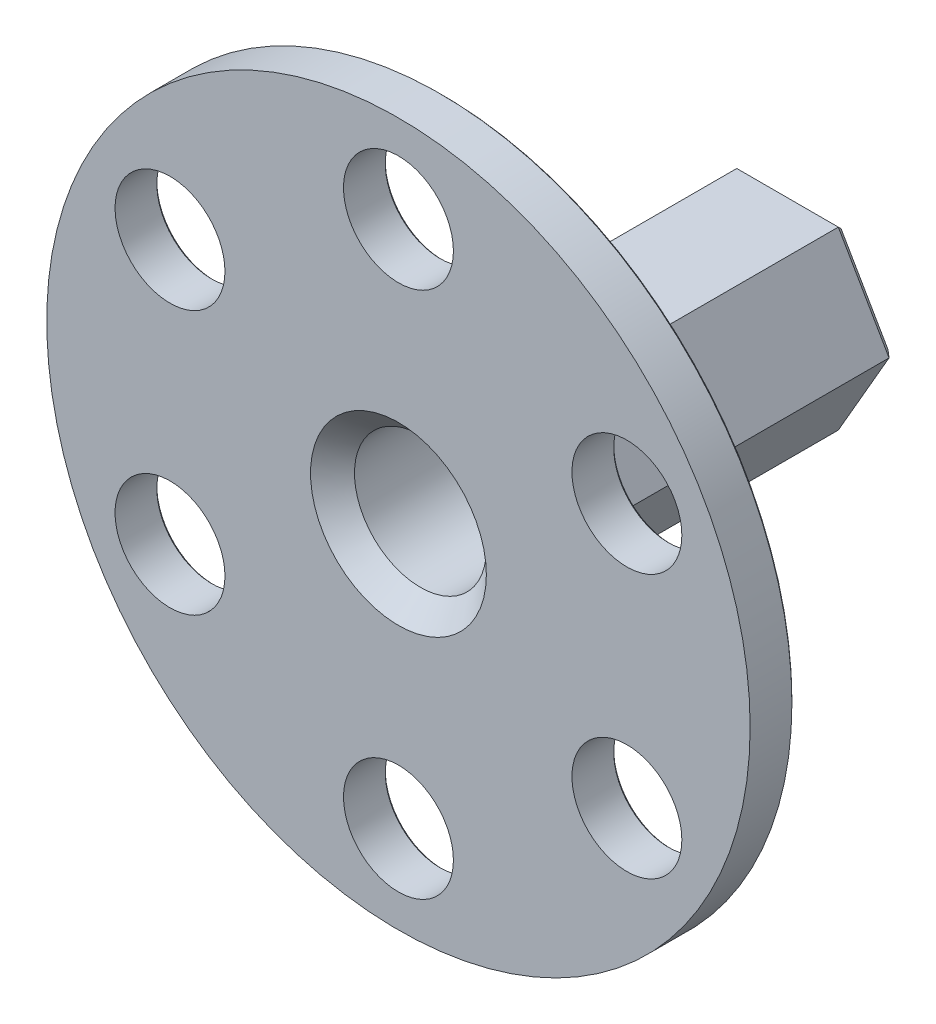
ISO-10303-21;
HEADER;
FILE_DESCRIPTION(('STEP AP214'),'2;1');
FILE_NAME('part.step','',(''),(''),'','','');
FILE_SCHEMA(('AUTOMOTIVE_DESIGN { 1 0 10303 214 1 1 1 1 }'));
ENDSEC;
DATA;
#1=APPLICATION_CONTEXT('core data for automotive mechanical design processes');
#2=APPLICATION_PROTOCOL_DEFINITION('international standard','automotive_design',2000,#1);
#3=PRODUCT_CONTEXT('',#1,'mechanical');
#4=PRODUCT('Part','Part','',(#3));
#5=PRODUCT_RELATED_PRODUCT_CATEGORY('part','',(#4));
#6=PRODUCT_DEFINITION_FORMATION('','',#4);
#7=PRODUCT_DEFINITION_CONTEXT('part definition',#1,'design');
#8=PRODUCT_DEFINITION('design','',#6,#7);
#9=PRODUCT_DEFINITION_SHAPE('','',#8);
#10=(LENGTH_UNIT() NAMED_UNIT(*) SI_UNIT(.MILLI.,.METRE.));
#11=(NAMED_UNIT(*) PLANE_ANGLE_UNIT() SI_UNIT($,.RADIAN.));
#12=(NAMED_UNIT(*) SI_UNIT($,.STERADIAN.) SOLID_ANGLE_UNIT());
#13=UNCERTAINTY_MEASURE_WITH_UNIT(LENGTH_MEASURE(1.E-05),#10,'distance_accuracy_value','');
#14=(GEOMETRIC_REPRESENTATION_CONTEXT(3) GLOBAL_UNCERTAINTY_ASSIGNED_CONTEXT((#13)) GLOBAL_UNIT_ASSIGNED_CONTEXT((#10,
#11,#12)) REPRESENTATION_CONTEXT('',''));
#15=CARTESIAN_POINT('',(0.,0.,0.));
#16=DIRECTION('',(0.,0.,1.));
#17=DIRECTION('',(1.,0.,0.));
#18=AXIS2_PLACEMENT_3D('',#15,#16,#17);
#19=CARTESIAN_POINT('',(0.,0.,-4.));
#20=DIRECTION('',(0.,0.,1.));
#21=DIRECTION('',(1.,0.,0.));
#22=AXIS2_PLACEMENT_3D('',#19,#20,#21);
#23=PLANE('',#22);
#24=CARTESIAN_POINT('',(0.,-24.,-4.));
#25=DIRECTION('',(0.,0.,1.));
#26=DIRECTION('',(1.,0.,0.));
#27=AXIS2_PLACEMENT_3D('',#24,#25,#26);
#28=CIRCLE('',#27,5.2);
#29=CARTESIAN_POINT('',(5.2,-24.,-4.));
#30=VERTEX_POINT('',#29);
#31=EDGE_CURVE('E219',#30,#30,#28,.T.);
#32=ORIENTED_EDGE('',*,*,#31,.T.);
#33=EDGE_LOOP('',(#32));
#34=FACE_BOUND('',#33,.T.);
#35=CARTESIAN_POINT('',(20.7846096908265,-12.0000000000001,-4.));
#36=DIRECTION('',(0.,0.,1.));
#37=DIRECTION('',(1.,0.,0.));
#38=AXIS2_PLACEMENT_3D('',#35,#36,#37);
#39=CIRCLE('',#38,5.20000000000001);
#40=CARTESIAN_POINT('',(25.9846096908265,-12.0000000000001,-4.));
#41=VERTEX_POINT('',#40);
#42=EDGE_CURVE('E216',#41,#41,#39,.T.);
#43=ORIENTED_EDGE('',*,*,#42,.T.);
#44=EDGE_LOOP('',(#43));
#45=FACE_BOUND('',#44,.T.);
#46=CARTESIAN_POINT('',(20.7846096908266,12.,-4.));
#47=DIRECTION('',(0.,0.,1.));
#48=DIRECTION('',(1.,0.,0.));
#49=AXIS2_PLACEMENT_3D('',#46,#47,#48);
#50=CIRCLE('',#49,5.2);
#51=CARTESIAN_POINT('',(25.9846096908266,12.,-4.));
#52=VERTEX_POINT('',#51);
#53=EDGE_CURVE('E213',#52,#52,#50,.T.);
#54=ORIENTED_EDGE('',*,*,#53,.T.);
#55=EDGE_LOOP('',(#54));
#56=FACE_BOUND('',#55,.T.);
#57=CARTESIAN_POINT('',(0.,24.,-4.));
#58=DIRECTION('',(0.,0.,1.));
#59=DIRECTION('',(1.,0.,0.));
#60=AXIS2_PLACEMENT_3D('',#57,#58,#59);
#61=CIRCLE('',#60,5.2);
#62=CARTESIAN_POINT('',(5.2,24.,-4.));
#63=VERTEX_POINT('',#62);
#64=EDGE_CURVE('E210',#63,#63,#61,.T.);
#65=ORIENTED_EDGE('',*,*,#64,.T.);
#66=EDGE_LOOP('',(#65));
#67=FACE_BOUND('',#66,.T.);
#68=CARTESIAN_POINT('',(-20.7846096908264,12.0000000000002,-4.));
#69=DIRECTION('',(0.,0.,1.));
#70=DIRECTION('',(1.,0.,0.));
#71=AXIS2_PLACEMENT_3D('',#68,#69,#70);
#72=CIRCLE('',#71,5.20000000000002);
#73=CARTESIAN_POINT('',(-15.5846096908264,12.0000000000002,-4.));
#74=VERTEX_POINT('',#73);
#75=EDGE_CURVE('E207',#74,#74,#72,.T.);
#76=ORIENTED_EDGE('',*,*,#75,.T.);
#77=EDGE_LOOP('',(#76));
#78=FACE_BOUND('',#77,.T.);
#79=CARTESIAN_POINT('',(-20.7846096908266,-11.9999999999998,-4.));
#80=DIRECTION('',(0.,0.,1.));
#81=DIRECTION('',(1.,0.,0.));
#82=AXIS2_PLACEMENT_3D('',#79,#80,#81);
#83=CIRCLE('',#82,5.20000000000002);
#84=CARTESIAN_POINT('',(-15.5846096908266,-11.9999999999998,-4.));
#85=VERTEX_POINT('',#84);
#86=EDGE_CURVE('E204',#85,#85,#83,.T.);
#87=ORIENTED_EDGE('',*,*,#86,.T.);
#88=EDGE_LOOP('',(#87));
#89=FACE_BOUND('',#88,.T.);
#90=CARTESIAN_POINT('',(0.,0.,-4.));
#91=DIRECTION('',(0.,0.,1.));
#92=DIRECTION('',(1.,0.,0.));
#93=AXIS2_PLACEMENT_3D('',#90,#91,#92);
#94=CIRCLE('',#93,31.8);
#95=CARTESIAN_POINT('',(31.8,0.,-4.));
#96=VERTEX_POINT('',#95);
#97=EDGE_CURVE('E188',#96,#96,#94,.F.);
#98=ORIENTED_EDGE('',*,*,#97,.T.);
#99=EDGE_LOOP('',(#98));
#100=FACE_BOUND('',#99,.T.);
#101=DIRECTION('',(0.5,0.866025403784439,0.));
#102=VECTOR('',#101,1.);
#103=CARTESIAN_POINT('',(10.9696551146029,-0.999999999999984,-4.));
#104=LINE('',#103,#102);
#105=CARTESIAN_POINT('',(5.77350269189624,-9.99999999999997,-4.));
#106=VERTEX_POINT('',#105);
#107=CARTESIAN_POINT('',(11.5470053837925,0.,-4.));
#108=VERTEX_POINT('',#107);
#109=EDGE_CURVE('E176',#106,#108,#104,.T.);
#110=ORIENTED_EDGE('',*,*,#109,.T.);
#111=DIRECTION('',(-0.5,0.866025403784439,0.));
#112=VECTOR('',#111,1.);
#113=CARTESIAN_POINT('',(6.35085296108586,8.99999999999999,-4.));
#114=LINE('',#113,#112);
#115=CARTESIAN_POINT('',(5.77350269189624,9.99999999999997,-4.));
#116=VERTEX_POINT('',#115);
#117=EDGE_CURVE('E147',#108,#116,#114,.T.);
#118=ORIENTED_EDGE('',*,*,#117,.T.);
#119=DIRECTION('',(-1.,0.,0.));
#120=VECTOR('',#119,1.);
#121=CARTESIAN_POINT('',(-4.61880215351701,9.99999999999997,-4.));
#122=LINE('',#121,#120);
#123=CARTESIAN_POINT('',(-5.77350269189624,9.99999999999997,-4.));
#124=VERTEX_POINT('',#123);
#125=EDGE_CURVE('E161',#116,#124,#122,.T.);
#126=ORIENTED_EDGE('',*,*,#125,.T.);
#127=DIRECTION('',(-0.5,-0.866025403784439,0.));
#128=VECTOR('',#127,1.);
#129=CARTESIAN_POINT('',(-10.9696551146029,0.999999999999987,-4.));
#130=LINE('',#129,#128);
#131=CARTESIAN_POINT('',(-11.5470053837925,0.,-4.));
#132=VERTEX_POINT('',#131);
#133=EDGE_CURVE('E164',#124,#132,#130,.T.);
#134=ORIENTED_EDGE('',*,*,#133,.T.);
#135=DIRECTION('',(0.5,-0.866025403784439,0.));
#136=VECTOR('',#135,1.);
#137=CARTESIAN_POINT('',(-6.35085296108586,-8.99999999999999,-4.));
#138=LINE('',#137,#136);
#139=CARTESIAN_POINT('',(-5.77350269189624,-9.99999999999997,-4.));
#140=VERTEX_POINT('',#139);
#141=EDGE_CURVE('E172',#132,#140,#138,.T.);
#142=ORIENTED_EDGE('',*,*,#141,.T.);
#143=DIRECTION('',(1.,0.,0.));
#144=VECTOR('',#143,1.);
#145=CARTESIAN_POINT('',(4.61880215351701,-9.99999999999997,-4.));
#146=LINE('',#145,#144);
#147=EDGE_CURVE('E174',#140,#106,#146,.T.);
#148=ORIENTED_EDGE('',*,*,#147,.T.);
#149=EDGE_LOOP('',(#110,#118,#126,#134,#142,#148));
#150=FACE_BOUND('',#149,.T.);
#151=ADVANCED_FACE('F39',(#34,#45,#56,#67,#78,#89,#100,#150),#23,.F.);
#152=CARTESIAN_POINT('',(0.,0.,-4.));
#153=DIRECTION('',(0.,0.,1.));
#154=DIRECTION('',(1.,0.,0.));
#155=AXIS2_PLACEMENT_3D('',#152,#153,#154);
#156=CYLINDRICAL_SURFACE('',#155,32.);
#157=CARTESIAN_POINT('',(0.,0.,-3.80000000000002));
#158=DIRECTION('',(0.,0.,1.));
#159=DIRECTION('',(1.,0.,0.));
#160=AXIS2_PLACEMENT_3D('',#157,#158,#159);
#161=CIRCLE('',#160,32.);
#162=CARTESIAN_POINT('',(32.,0.,-3.80000000000002));
#163=VERTEX_POINT('',#162);
#164=EDGE_CURVE('E240',#163,#163,#161,.T.);
#165=ORIENTED_EDGE('',*,*,#164,.T.);
#166=EDGE_LOOP('',(#165));
#167=FACE_BOUND('',#166,.T.);
#168=CARTESIAN_POINT('',(0.,0.,0.));
#169=DIRECTION('',(0.,0.,1.));
#170=DIRECTION('',(1.,0.,0.));
#171=AXIS2_PLACEMENT_3D('',#168,#169,#170);
#172=CIRCLE('',#171,32.);
#173=CARTESIAN_POINT('',(32.,0.,0.));
#174=VERTEX_POINT('',#173);
#175=EDGE_CURVE('E162',#174,#174,#172,.T.);
#176=ORIENTED_EDGE('',*,*,#175,.F.);
#177=EDGE_LOOP('',(#176));
#178=FACE_BOUND('',#177,.T.);
#179=ADVANCED_FACE('F303',(#167,#178),#156,.T.);
#180=CARTESIAN_POINT('',(0.,0.,0.));
#181=DIRECTION('',(0.,0.,1.));
#182=DIRECTION('',(1.,0.,0.));
#183=AXIS2_PLACEMENT_3D('',#180,#181,#182);
#184=PLANE('',#183);
#185=CARTESIAN_POINT('',(0.,0.,0.));
#186=DIRECTION('',(0.,0.,1.));
#187=DIRECTION('',(1.,0.,0.));
#188=AXIS2_PLACEMENT_3D('',#185,#186,#187);
#189=CIRCLE('',#188,7.99999999999998);
#190=CARTESIAN_POINT('',(7.99999999999998,0.,0.));
#191=VERTEX_POINT('',#190);
#192=EDGE_CURVE('E11',#191,#191,#189,.F.);
#193=ORIENTED_EDGE('',*,*,#192,.T.);
#194=EDGE_LOOP('',(#193));
#195=FACE_BOUND('',#194,.T.);
#196=CARTESIAN_POINT('',(-20.7846096908264,12.0000000000002,0.));
#197=DIRECTION('',(0.,0.,1.));
#198=DIRECTION('',(0.50000000000001,0.866025403784433,0.));
#199=AXIS2_PLACEMENT_3D('',#196,#197,#198);
#200=CIRCLE('',#199,5.);
#201=CARTESIAN_POINT('',(-18.2846096908263,16.3301270189224,0.));
#202=VERTEX_POINT('',#201);
#203=EDGE_CURVE('E547',#202,#202,#200,.T.);
#204=ORIENTED_EDGE('',*,*,#203,.F.);
#205=EDGE_LOOP('',(#204));
#206=FACE_BOUND('',#205,.T.);
#207=CARTESIAN_POINT('',(-20.7846096908266,-11.9999999999998,0.));
#208=DIRECTION('',(0.,0.,1.));
#209=DIRECTION('',(-0.499999999999992,0.866025403784443,0.));
#210=AXIS2_PLACEMENT_3D('',#207,#208,#209);
#211=CIRCLE('',#210,5.);
#212=CARTESIAN_POINT('',(-23.2846096908266,-7.66987298107759,0.));
#213=VERTEX_POINT('',#212);
#214=EDGE_CURVE('E550',#213,#213,#211,.T.);
#215=ORIENTED_EDGE('',*,*,#214,.F.);
#216=EDGE_LOOP('',(#215));
#217=FACE_BOUND('',#216,.T.);
#218=CARTESIAN_POINT('',(0.,-24.,0.));
#219=DIRECTION('',(0.,0.,1.));
#220=DIRECTION('',(-1.,0.,0.));
#221=AXIS2_PLACEMENT_3D('',#218,#219,#220);
#222=CIRCLE('',#221,5.);
#223=CARTESIAN_POINT('',(-5.,-24.,0.));
#224=VERTEX_POINT('',#223);
#225=EDGE_CURVE('E544',#224,#224,#222,.T.);
#226=ORIENTED_EDGE('',*,*,#225,.F.);
#227=EDGE_LOOP('',(#226));
#228=FACE_BOUND('',#227,.T.);
#229=CARTESIAN_POINT('',(20.7846096908265,-12.0000000000001,0.));
#230=DIRECTION('',(0.,0.,1.));
#231=DIRECTION('',(-0.500000000000004,-0.866025403784436,0.));
#232=AXIS2_PLACEMENT_3D('',#229,#230,#231);
#233=CIRCLE('',#232,5.);
#234=CARTESIAN_POINT('',(18.2846096908265,-16.3301270189223,0.));
#235=VERTEX_POINT('',#234);
#236=EDGE_CURVE('E540',#235,#235,#233,.T.);
#237=ORIENTED_EDGE('',*,*,#236,.F.);
#238=EDGE_LOOP('',(#237));
#239=FACE_BOUND('',#238,.T.);
#240=CARTESIAN_POINT('',(20.7846096908266,12.,0.));
#241=DIRECTION('',(0.,0.,1.));
#242=DIRECTION('',(0.499999999999998,-0.86602540378444,0.));
#243=AXIS2_PLACEMENT_3D('',#240,#241,#242);
#244=CIRCLE('',#243,5.);
#245=CARTESIAN_POINT('',(23.2846096908265,7.66987298107775,0.));
#246=VERTEX_POINT('',#245);
#247=EDGE_CURVE('E538',#246,#246,#244,.T.);
#248=ORIENTED_EDGE('',*,*,#247,.F.);
#249=EDGE_LOOP('',(#248));
#250=FACE_BOUND('',#249,.T.);
#251=CARTESIAN_POINT('',(0.,24.,0.));
#252=DIRECTION('',(0.,0.,1.));
#253=DIRECTION('',(1.,0.,0.));
#254=AXIS2_PLACEMENT_3D('',#251,#252,#253);
#255=CIRCLE('',#254,5.);
#256=CARTESIAN_POINT('',(5.,24.,0.));
#257=VERTEX_POINT('',#256);
#258=EDGE_CURVE('E167',#257,#257,#255,.T.);
#259=ORIENTED_EDGE('',*,*,#258,.F.);
#260=EDGE_LOOP('',(#259));
#261=FACE_BOUND('',#260,.T.);
#262=ORIENTED_EDGE('',*,*,#175,.T.);
#263=EDGE_LOOP('',(#262));
#264=FACE_BOUND('',#263,.T.);
#265=ADVANCED_FACE('F310',(#195,#206,#217,#228,#239,#250,#261,#264),#184,.T.);
#266=CARTESIAN_POINT('',(0.,24.,-4.));
#267=DIRECTION('',(0.,0.,1.));
#268=DIRECTION('',(1.,0.,0.));
#269=AXIS2_PLACEMENT_3D('',#266,#267,#268);
#270=CYLINDRICAL_SURFACE('',#269,5.);
#271=CARTESIAN_POINT('',(0.,24.,-3.8));
#272=DIRECTION('',(0.,0.,1.));
#273=DIRECTION('',(1.,0.,0.));
#274=AXIS2_PLACEMENT_3D('',#271,#272,#273);
#275=CIRCLE('',#274,5.);
#276=CARTESIAN_POINT('',(5.,24.,-3.8));
#277=VERTEX_POINT('',#276);
#278=EDGE_CURVE('E231',#277,#277,#275,.F.);
#279=ORIENTED_EDGE('',*,*,#278,.T.);
#280=EDGE_LOOP('',(#279));
#281=FACE_BOUND('',#280,.T.);
#282=ORIENTED_EDGE('',*,*,#258,.T.);
#283=EDGE_LOOP('',(#282));
#284=FACE_BOUND('',#283,.T.);
#285=ADVANCED_FACE('F316',(#281,#284),#270,.F.);
#286=CARTESIAN_POINT('',(20.7846096908266,12.,-4.));
#287=DIRECTION('',(0.,0.,1.));
#288=DIRECTION('',(1.,0.,0.));
#289=AXIS2_PLACEMENT_3D('',#286,#287,#288);
#290=CYLINDRICAL_SURFACE('',#289,5.);
#291=CARTESIAN_POINT('',(20.7846096908266,12.,-3.8));
#292=DIRECTION('',(0.,0.,1.));
#293=DIRECTION('',(1.,0.,0.));
#294=AXIS2_PLACEMENT_3D('',#291,#292,#293);
#295=CIRCLE('',#294,5.);
#296=CARTESIAN_POINT('',(25.7846096908266,12.,-3.8));
#297=VERTEX_POINT('',#296);
#298=EDGE_CURVE('E228',#297,#297,#295,.F.);
#299=ORIENTED_EDGE('',*,*,#298,.T.);
#300=EDGE_LOOP('',(#299));
#301=FACE_BOUND('',#300,.T.);
#302=ORIENTED_EDGE('',*,*,#247,.T.);
#303=EDGE_LOOP('',(#302));
#304=FACE_BOUND('',#303,.T.);
#305=ADVANCED_FACE('F517',(#301,#304),#290,.F.);
#306=CARTESIAN_POINT('',(20.7846096908265,-12.0000000000001,-4.));
#307=DIRECTION('',(0.,0.,1.));
#308=DIRECTION('',(1.,0.,0.));
#309=AXIS2_PLACEMENT_3D('',#306,#307,#308);
#310=CYLINDRICAL_SURFACE('',#309,5.);
#311=CARTESIAN_POINT('',(20.7846096908265,-12.0000000000001,-3.8));
#312=DIRECTION('',(0.,0.,1.));
#313=DIRECTION('',(1.,0.,0.));
#314=AXIS2_PLACEMENT_3D('',#311,#312,#313);
#315=CIRCLE('',#314,5.);
#316=CARTESIAN_POINT('',(25.7846096908265,-12.0000000000001,-3.8));
#317=VERTEX_POINT('',#316);
#318=EDGE_CURVE('E225',#317,#317,#315,.F.);
#319=ORIENTED_EDGE('',*,*,#318,.T.);
#320=EDGE_LOOP('',(#319));
#321=FACE_BOUND('',#320,.T.);
#322=ORIENTED_EDGE('',*,*,#236,.T.);
#323=EDGE_LOOP('',(#322));
#324=FACE_BOUND('',#323,.T.);
#325=ADVANCED_FACE('F513',(#321,#324),#310,.F.);
#326=CARTESIAN_POINT('',(0.,-24.,-4.));
#327=DIRECTION('',(0.,0.,1.));
#328=DIRECTION('',(1.,0.,0.));
#329=AXIS2_PLACEMENT_3D('',#326,#327,#328);
#330=CYLINDRICAL_SURFACE('',#329,5.);
#331=CARTESIAN_POINT('',(0.,-24.,-3.8));
#332=DIRECTION('',(0.,0.,1.));
#333=DIRECTION('',(1.,0.,0.));
#334=AXIS2_PLACEMENT_3D('',#331,#332,#333);
#335=CIRCLE('',#334,5.);
#336=CARTESIAN_POINT('',(5.,-24.,-3.8));
#337=VERTEX_POINT('',#336);
#338=EDGE_CURVE('E222',#337,#337,#335,.F.);
#339=ORIENTED_EDGE('',*,*,#338,.T.);
#340=EDGE_LOOP('',(#339));
#341=FACE_BOUND('',#340,.T.);
#342=ORIENTED_EDGE('',*,*,#225,.T.);
#343=EDGE_LOOP('',(#342));
#344=FACE_BOUND('',#343,.T.);
#345=ADVANCED_FACE('F516',(#341,#344),#330,.F.);
#346=CARTESIAN_POINT('',(-20.7846096908266,-11.9999999999998,-4.));
#347=DIRECTION('',(0.,0.,1.));
#348=DIRECTION('',(1.,0.,0.));
#349=AXIS2_PLACEMENT_3D('',#346,#347,#348);
#350=CYLINDRICAL_SURFACE('',#349,5.);
#351=CARTESIAN_POINT('',(-20.7846096908266,-11.9999999999998,-3.79999999999999));
#352=DIRECTION('',(0.,0.,1.));
#353=DIRECTION('',(1.,0.,0.));
#354=AXIS2_PLACEMENT_3D('',#351,#352,#353);
#355=CIRCLE('',#354,5.);
#356=CARTESIAN_POINT('',(-15.7846096908266,-11.9999999999998,-3.79999999999999));
#357=VERTEX_POINT('',#356);
#358=EDGE_CURVE('E237',#357,#357,#355,.F.);
#359=ORIENTED_EDGE('',*,*,#358,.T.);
#360=EDGE_LOOP('',(#359));
#361=FACE_BOUND('',#360,.T.);
#362=ORIENTED_EDGE('',*,*,#214,.T.);
#363=EDGE_LOOP('',(#362));
#364=FACE_BOUND('',#363,.T.);
#365=ADVANCED_FACE('F521',(#361,#364),#350,.F.);
#366=CARTESIAN_POINT('',(-20.7846096908264,12.0000000000002,-4.));
#367=DIRECTION('',(0.,0.,1.));
#368=DIRECTION('',(1.,0.,0.));
#369=AXIS2_PLACEMENT_3D('',#366,#367,#368);
#370=CYLINDRICAL_SURFACE('',#369,5.);
#371=CARTESIAN_POINT('',(-20.7846096908264,12.0000000000002,-3.79999999999998));
#372=DIRECTION('',(0.,0.,1.));
#373=DIRECTION('',(1.,0.,0.));
#374=AXIS2_PLACEMENT_3D('',#371,#372,#373);
#375=CIRCLE('',#374,5.);
#376=CARTESIAN_POINT('',(-15.7846096908264,12.0000000000002,-3.79999999999998));
#377=VERTEX_POINT('',#376);
#378=EDGE_CURVE('E234',#377,#377,#375,.F.);
#379=ORIENTED_EDGE('',*,*,#378,.T.);
#380=EDGE_LOOP('',(#379));
#381=FACE_BOUND('',#380,.T.);
#382=ORIENTED_EDGE('',*,*,#203,.T.);
#383=EDGE_LOOP('',(#382));
#384=FACE_BOUND('',#383,.T.);
#385=ADVANCED_FACE('F512',(#381,#384),#370,.F.);
#386=CARTESIAN_POINT('',(-4.61880215351701,8.,-36.));
#387=DIRECTION('',(0.,-1.,0.));
#388=DIRECTION('',(1.,0.,0.));
#389=AXIS2_PLACEMENT_3D('',#386,#387,#388);
#390=PLANE('',#389);
#391=DIRECTION('',(0.,0.,1.));
#392=VECTOR('',#391,1.);
#393=CARTESIAN_POINT('',(4.61880215351701,8.,-36.));
#394=LINE('',#393,#392);
#395=CARTESIAN_POINT('',(4.61880215351701,8.,-35.4));
#396=VERTEX_POINT('',#395);
#397=CARTESIAN_POINT('',(4.61880215351701,8.,-5.99999999999999));
#398=VERTEX_POINT('',#397);
#399=EDGE_CURVE('E136',#396,#398,#394,.T.);
#400=ORIENTED_EDGE('',*,*,#399,.F.);
#401=DIRECTION('',(-1.,0.,0.));
#402=VECTOR('',#401,1.);
#403=CARTESIAN_POINT('',(-4.61880215351701,8.,-35.4));
#404=LINE('',#403,#402);
#405=CARTESIAN_POINT('',(-4.61880215351701,8.,-35.4));
#406=VERTEX_POINT('',#405);
#407=EDGE_CURVE('E265',#396,#406,#404,.T.);
#408=ORIENTED_EDGE('',*,*,#407,.T.);
#409=DIRECTION('',(0.,0.,1.));
#410=VECTOR('',#409,1.);
#411=CARTESIAN_POINT('',(-4.61880215351701,8.,-36.));
#412=LINE('',#411,#410);
#413=CARTESIAN_POINT('',(-4.61880215351701,8.,-5.99999999999999));
#414=VERTEX_POINT('',#413);
#415=EDGE_CURVE('E201',#406,#414,#412,.T.);
#416=ORIENTED_EDGE('',*,*,#415,.T.);
#417=DIRECTION('',(1.,0.,0.));
#418=VECTOR('',#417,1.);
#419=CARTESIAN_POINT('',(4.61880215351701,8.,-5.99999999999999));
#420=LINE('',#419,#418);
#421=EDGE_CURVE('E187',#414,#398,#420,.T.);
#422=ORIENTED_EDGE('',*,*,#421,.T.);
#423=EDGE_LOOP('',(#400,#408,#416,#422));
#424=FACE_BOUND('',#423,.T.);
#425=ADVANCED_FACE('F469',(#424),#390,.F.);
#426=CARTESIAN_POINT('',(4.61880215351701,8.,-36.));
#427=DIRECTION('',(-0.866025403784439,-0.5,0.));
#428=DIRECTION('',(0.5,-0.866025403784439,0.));
#429=AXIS2_PLACEMENT_3D('',#426,#427,#428);
#430=PLANE('',#429);
#431=DIRECTION('',(0.,0.,1.));
#432=VECTOR('',#431,1.);
#433=CARTESIAN_POINT('',(9.23760430703401,0.,-36.));
#434=LINE('',#433,#432);
#435=CARTESIAN_POINT('',(9.23760430703401,0.,-35.4));
#436=VERTEX_POINT('',#435);
#437=CARTESIAN_POINT('',(9.23760430703401,0.,-5.99999999999999));
#438=VERTEX_POINT('',#437);
#439=EDGE_CURVE('E128',#436,#438,#434,.T.);
#440=ORIENTED_EDGE('',*,*,#439,.F.);
#441=DIRECTION('',(-0.5,0.866025403784439,0.));
#442=VECTOR('',#441,1.);
#443=CARTESIAN_POINT('',(4.61880215351701,8.,-35.4));
#444=LINE('',#443,#442);
#445=EDGE_CURVE('E55',#436,#396,#444,.T.);
#446=ORIENTED_EDGE('',*,*,#445,.T.);
#447=ORIENTED_EDGE('',*,*,#399,.T.);
#448=DIRECTION('',(0.5,-0.866025403784439,0.));
#449=VECTOR('',#448,1.);
#450=CARTESIAN_POINT('',(9.23760430703401,0.,-5.99999999999999));
#451=LINE('',#450,#449);
#452=EDGE_CURVE('E145',#398,#438,#451,.T.);
#453=ORIENTED_EDGE('',*,*,#452,.T.);
#454=EDGE_LOOP('',(#440,#446,#447,#453));
#455=FACE_BOUND('',#454,.T.);
#456=ADVANCED_FACE('F159',(#455),#430,.F.);
#457=CARTESIAN_POINT('',(9.23760430703401,0.,-36.));
#458=DIRECTION('',(-0.866025403784439,0.5,0.));
#459=DIRECTION('',(-0.5,-0.866025403784439,0.));
#460=AXIS2_PLACEMENT_3D('',#457,#458,#459);
#461=PLANE('',#460);
#462=DIRECTION('',(0.,0.,1.));
#463=VECTOR('',#462,1.);
#464=CARTESIAN_POINT('',(4.61880215351701,-8.,-36.));
#465=LINE('',#464,#463);
#466=CARTESIAN_POINT('',(4.61880215351701,-8.,-35.4));
#467=VERTEX_POINT('',#466);
#468=CARTESIAN_POINT('',(4.61880215351701,-8.,-5.99999999999999));
#469=VERTEX_POINT('',#468);
#470=EDGE_CURVE('E137',#467,#469,#465,.T.);
#471=ORIENTED_EDGE('',*,*,#470,.F.);
#472=DIRECTION('',(0.5,0.866025403784439,0.));
#473=VECTOR('',#472,1.);
#474=CARTESIAN_POINT('',(9.23760430703401,0.,-35.4));
#475=LINE('',#474,#473);
#476=EDGE_CURVE('E63',#467,#436,#475,.T.);
#477=ORIENTED_EDGE('',*,*,#476,.T.);
#478=ORIENTED_EDGE('',*,*,#439,.T.);
#479=DIRECTION('',(-0.5,-0.866025403784439,0.));
#480=VECTOR('',#479,1.);
#481=CARTESIAN_POINT('',(4.61880215351701,-8.,-5.99999999999999));
#482=LINE('',#481,#480);
#483=EDGE_CURVE('E132',#438,#469,#482,.T.);
#484=ORIENTED_EDGE('',*,*,#483,.T.);
#485=EDGE_LOOP('',(#471,#477,#478,#484));
#486=FACE_BOUND('',#485,.T.);
#487=ADVANCED_FACE('F130',(#486),#461,.F.);
#488=CARTESIAN_POINT('',(4.61880215351701,-8.,-36.));
#489=DIRECTION('',(0.,1.,0.));
#490=DIRECTION('',(0.,0.,1.));
#491=AXIS2_PLACEMENT_3D('',#488,#489,#490);
#492=PLANE('',#491);
#493=DIRECTION('',(0.,0.,1.));
#494=VECTOR('',#493,1.);
#495=CARTESIAN_POINT('',(-4.61880215351701,-8.,-36.));
#496=LINE('',#495,#494);
#497=CARTESIAN_POINT('',(-4.61880215351701,-8.,-35.4));
#498=VERTEX_POINT('',#497);
#499=CARTESIAN_POINT('',(-4.61880215351701,-8.,-5.99999999999999));
#500=VERTEX_POINT('',#499);
#501=EDGE_CURVE('E486',#498,#500,#496,.T.);
#502=ORIENTED_EDGE('',*,*,#501,.F.);
#503=DIRECTION('',(1.,0.,0.));
#504=VECTOR('',#503,1.);
#505=CARTESIAN_POINT('',(4.61880215351701,-8.,-35.4));
#506=LINE('',#505,#504);
#507=EDGE_CURVE('E261',#498,#467,#506,.T.);
#508=ORIENTED_EDGE('',*,*,#507,.T.);
#509=ORIENTED_EDGE('',*,*,#470,.T.);
#510=DIRECTION('',(-1.,0.,0.));
#511=VECTOR('',#510,1.);
#512=CARTESIAN_POINT('',(-4.61880215351701,-8.,-5.99999999999999));
#513=LINE('',#512,#511);
#514=EDGE_CURVE('E157',#469,#500,#513,.T.);
#515=ORIENTED_EDGE('',*,*,#514,.T.);
#516=EDGE_LOOP('',(#502,#508,#509,#515));
#517=FACE_BOUND('',#516,.T.);
#518=ADVANCED_FACE('F489',(#517),#492,.F.);
#519=CARTESIAN_POINT('',(-4.61880215351701,-8.,-36.));
#520=DIRECTION('',(0.866025403784439,0.5,0.));
#521=DIRECTION('',(-0.5,0.866025403784439,0.));
#522=AXIS2_PLACEMENT_3D('',#519,#520,#521);
#523=PLANE('',#522);
#524=DIRECTION('',(0.,0.,1.));
#525=VECTOR('',#524,1.);
#526=CARTESIAN_POINT('',(-9.23760430703402,0.,-36.));
#527=LINE('',#526,#525);
#528=CARTESIAN_POINT('',(-9.23760430703402,0.,-35.4));
#529=VERTEX_POINT('',#528);
#530=CARTESIAN_POINT('',(-9.23760430703402,0.,-5.99999999999999));
#531=VERTEX_POINT('',#530);
#532=EDGE_CURVE('E476',#529,#531,#527,.T.);
#533=ORIENTED_EDGE('',*,*,#532,.F.);
#534=DIRECTION('',(0.5,-0.866025403784439,0.));
#535=VECTOR('',#534,1.);
#536=CARTESIAN_POINT('',(-4.61880215351701,-8.,-35.4));
#537=LINE('',#536,#535);
#538=EDGE_CURVE('E259',#529,#498,#537,.T.);
#539=ORIENTED_EDGE('',*,*,#538,.T.);
#540=ORIENTED_EDGE('',*,*,#501,.T.);
#541=DIRECTION('',(-0.5,0.866025403784439,0.));
#542=VECTOR('',#541,1.);
#543=CARTESIAN_POINT('',(-9.23760430703402,0.,-5.99999999999999));
#544=LINE('',#543,#542);
#545=EDGE_CURVE('E181',#500,#531,#544,.T.);
#546=ORIENTED_EDGE('',*,*,#545,.T.);
#547=EDGE_LOOP('',(#533,#539,#540,#546));
#548=FACE_BOUND('',#547,.T.);
#549=ADVANCED_FACE('F485',(#548),#523,.F.);
#550=CARTESIAN_POINT('',(-9.23760430703402,0.,-36.));
#551=DIRECTION('',(0.866025403784439,-0.5,0.));
#552=DIRECTION('',(0.5,0.866025403784439,0.));
#553=AXIS2_PLACEMENT_3D('',#550,#551,#552);
#554=PLANE('',#553);
#555=ORIENTED_EDGE('',*,*,#415,.F.);
#556=DIRECTION('',(-0.5,-0.866025403784439,0.));
#557=VECTOR('',#556,1.);
#558=CARTESIAN_POINT('',(-9.23760430703402,0.,-35.4));
#559=LINE('',#558,#557);
#560=EDGE_CURVE('E256',#406,#529,#559,.T.);
#561=ORIENTED_EDGE('',*,*,#560,.T.);
#562=ORIENTED_EDGE('',*,*,#532,.T.);
#563=DIRECTION('',(0.5,0.866025403784439,0.));
#564=VECTOR('',#563,1.);
#565=CARTESIAN_POINT('',(-4.61880215351701,8.,-5.99999999999999));
#566=LINE('',#565,#564);
#567=EDGE_CURVE('E184',#531,#414,#566,.T.);
#568=ORIENTED_EDGE('',*,*,#567,.T.);
#569=EDGE_LOOP('',(#555,#561,#562,#568));
#570=FACE_BOUND('',#569,.T.);
#571=ADVANCED_FACE('F472',(#570),#554,.F.);
#572=CARTESIAN_POINT('',(0.,0.,-36.));
#573=DIRECTION('',(0.,0.,-1.));
#574=DIRECTION('',(-1.,0.,0.));
#575=AXIS2_PLACEMENT_3D('',#572,#573,#574);
#576=PLANE('',#575);
#577=DIRECTION('',(-0.5,0.866025403784439,0.));
#578=VECTOR('',#577,1.);
#579=CARTESIAN_POINT('',(-8.71798906476334,0.300000000000009,-36.));
#580=LINE('',#579,#578);
#581=CARTESIAN_POINT('',(-4.27239199200322,-7.39999999999998,-36.));
#582=VERTEX_POINT('',#581);
#583=CARTESIAN_POINT('',(-8.54478398400645,0.,-36.));
#584=VERTEX_POINT('',#583);
#585=EDGE_CURVE('E251',#582,#584,#580,.T.);
#586=ORIENTED_EDGE('',*,*,#585,.T.);
#587=DIRECTION('',(0.5,0.866025403784439,0.));
#588=VECTOR('',#587,1.);
#589=CARTESIAN_POINT('',(-4.09918691124633,7.69999999999999,-36.));
#590=LINE('',#589,#588);
#591=CARTESIAN_POINT('',(-4.27239199200322,7.39999999999998,-36.));
#592=VERTEX_POINT('',#591);
#593=EDGE_CURVE('E253',#584,#592,#590,.T.);
#594=ORIENTED_EDGE('',*,*,#593,.T.);
#595=DIRECTION('',(1.,0.,0.));
#596=VECTOR('',#595,1.);
#597=CARTESIAN_POINT('',(4.61880215351701,7.39999999999998,-36.));
#598=LINE('',#597,#596);
#599=CARTESIAN_POINT('',(4.27239199200322,7.39999999999998,-36.));
#600=VERTEX_POINT('',#599);
#601=EDGE_CURVE('E243',#592,#600,#598,.T.);
#602=ORIENTED_EDGE('',*,*,#601,.T.);
#603=DIRECTION('',(0.5,-0.866025403784439,0.));
#604=VECTOR('',#603,1.);
#605=CARTESIAN_POINT('',(8.71798906476333,-0.300000000000007,-36.));
#606=LINE('',#605,#604);
#607=CARTESIAN_POINT('',(8.54478398400644,0.,-36.));
#608=VERTEX_POINT('',#607);
#609=EDGE_CURVE('E245',#600,#608,#606,.T.);
#610=ORIENTED_EDGE('',*,*,#609,.T.);
#611=DIRECTION('',(-0.5,-0.866025403784439,0.));
#612=VECTOR('',#611,1.);
#613=CARTESIAN_POINT('',(4.09918691124633,-7.69999999999999,-36.));
#614=LINE('',#613,#612);
#615=CARTESIAN_POINT('',(4.27239199200322,-7.39999999999998,-36.));
#616=VERTEX_POINT('',#615);
#617=EDGE_CURVE('E247',#608,#616,#614,.T.);
#618=ORIENTED_EDGE('',*,*,#617,.T.);
#619=DIRECTION('',(-1.,0.,0.));
#620=VECTOR('',#619,1.);
#621=CARTESIAN_POINT('',(-4.61880215351701,-7.39999999999998,-36.));
#622=LINE('',#621,#620);
#623=EDGE_CURVE('E249',#616,#582,#622,.T.);
#624=ORIENTED_EDGE('',*,*,#623,.T.);
#625=EDGE_LOOP('',(#586,#594,#602,#610,#618,#624));
#626=FACE_BOUND('',#625,.T.);
#627=ADVANCED_FACE('F360',(#626),#576,.T.);
#628=CARTESIAN_POINT('',(-4.61880215351701,-8.,-5.99999999999999));
#629=DIRECTION('',(-0.612372435695797,-0.353553390593275,-0.707106781186545));
#630=DIRECTION('',(0.5,-0.866025403784439,0.));
#631=AXIS2_PLACEMENT_3D('',#628,#629,#630);
#632=PLANE('',#631);
#633=DIRECTION('',(-0.377964473009226,-0.654653670707975,0.65465367070798));
#634=VECTOR('',#633,1.);
#635=CARTESIAN_POINT('',(-4.61880215351701,-8.,-5.99999999999999));
#636=LINE('',#635,#634);
#637=EDGE_CURVE('E195',#140,#500,#636,.F.);
#638=ORIENTED_EDGE('',*,*,#637,.F.);
#639=ORIENTED_EDGE('',*,*,#141,.F.);
#640=DIRECTION('',(-0.755928946018452,0.,0.65465367070798));
#641=VECTOR('',#640,1.);
#642=CARTESIAN_POINT('',(-9.23760430703402,0.,-5.99999999999999));
#643=LINE('',#642,#641);
#644=EDGE_CURVE('E198',#531,#132,#643,.T.);
#645=ORIENTED_EDGE('',*,*,#644,.F.);
#646=ORIENTED_EDGE('',*,*,#545,.F.);
#647=EDGE_LOOP('',(#638,#639,#645,#646));
#648=FACE_BOUND('',#647,.T.);
#649=ADVANCED_FACE('F354',(#648),#632,.T.);
#650=CARTESIAN_POINT('',(-9.23760430703402,0.,-5.99999999999999));
#651=DIRECTION('',(-0.612372435695797,0.353553390593275,-0.707106781186545));
#652=DIRECTION('',(-0.5,-0.866025403784439,0.));
#653=AXIS2_PLACEMENT_3D('',#650,#651,#652);
#654=PLANE('',#653);
#655=ORIENTED_EDGE('',*,*,#644,.T.);
#656=ORIENTED_EDGE('',*,*,#133,.F.);
#657=DIRECTION('',(-0.377964473009226,0.654653670707975,0.65465367070798));
#658=VECTOR('',#657,1.);
#659=CARTESIAN_POINT('',(-4.61880215351701,8.,-5.99999999999999));
#660=LINE('',#659,#658);
#661=EDGE_CURVE('E192',#414,#124,#660,.T.);
#662=ORIENTED_EDGE('',*,*,#661,.F.);
#663=ORIENTED_EDGE('',*,*,#567,.F.);
#664=EDGE_LOOP('',(#655,#656,#662,#663));
#665=FACE_BOUND('',#664,.T.);
#666=ADVANCED_FACE('F347',(#665),#654,.T.);
#667=CARTESIAN_POINT('',(4.61880215351701,-8.,-5.99999999999999));
#668=DIRECTION('',(0.,-0.70710678118655,-0.707106781186545));
#669=DIRECTION('',(1.,0.,0.));
#670=AXIS2_PLACEMENT_3D('',#667,#668,#669);
#671=PLANE('',#670);
#672=ORIENTED_EDGE('',*,*,#637,.T.);
#673=ORIENTED_EDGE('',*,*,#514,.F.);
#674=DIRECTION('',(0.377964473009226,-0.654653670707975,0.65465367070798));
#675=VECTOR('',#674,1.);
#676=CARTESIAN_POINT('',(4.61880215351701,-8.,-5.99999999999999));
#677=LINE('',#676,#675);
#678=EDGE_CURVE('E156',#106,#469,#677,.F.);
#679=ORIENTED_EDGE('',*,*,#678,.F.);
#680=ORIENTED_EDGE('',*,*,#147,.F.);
#681=EDGE_LOOP('',(#672,#673,#679,#680));
#682=FACE_BOUND('',#681,.T.);
#683=ADVANCED_FACE('F340',(#682),#671,.T.);
#684=CARTESIAN_POINT('',(-4.61880215351701,8.,-5.99999999999999));
#685=DIRECTION('',(0.,0.70710678118655,-0.707106781186545));
#686=DIRECTION('',(-1.,0.,0.));
#687=AXIS2_PLACEMENT_3D('',#684,#685,#686);
#688=PLANE('',#687);
#689=ORIENTED_EDGE('',*,*,#661,.T.);
#690=ORIENTED_EDGE('',*,*,#125,.F.);
#691=DIRECTION('',(-0.377964473009227,-0.654653670707975,-0.65465367070798));
#692=VECTOR('',#691,1.);
#693=CARTESIAN_POINT('',(3.2991443953693,5.71428571428572,-8.28571428571428));
#694=LINE('',#693,#692);
#695=EDGE_CURVE('E150',#398,#116,#694,.F.);
#696=ORIENTED_EDGE('',*,*,#695,.F.);
#697=ORIENTED_EDGE('',*,*,#421,.F.);
#698=EDGE_LOOP('',(#689,#690,#696,#697));
#699=FACE_BOUND('',#698,.T.);
#700=ADVANCED_FACE('F334',(#699),#688,.T.);
#701=CARTESIAN_POINT('',(9.23760430703401,0.,-5.99999999999999));
#702=DIRECTION('',(0.612372435695797,-0.353553390593275,-0.707106781186545));
#703=DIRECTION('',(0.5,0.866025403784439,0.));
#704=AXIS2_PLACEMENT_3D('',#701,#702,#703);
#705=PLANE('',#704);
#706=ORIENTED_EDGE('',*,*,#678,.T.);
#707=ORIENTED_EDGE('',*,*,#483,.F.);
#708=DIRECTION('',(0.755928946018452,0.,0.65465367070798));
#709=VECTOR('',#708,1.);
#710=CARTESIAN_POINT('',(9.23760430703401,0.,-5.99999999999999));
#711=LINE('',#710,#709);
#712=EDGE_CURVE('E143',#108,#438,#711,.F.);
#713=ORIENTED_EDGE('',*,*,#712,.F.);
#714=ORIENTED_EDGE('',*,*,#109,.F.);
#715=EDGE_LOOP('',(#706,#707,#713,#714));
#716=FACE_BOUND('',#715,.T.);
#717=ADVANCED_FACE('F154',(#716),#705,.T.);
#718=CARTESIAN_POINT('',(4.61880215351701,8.,-5.99999999999999));
#719=DIRECTION('',(0.612372435695797,0.353553390593275,-0.707106781186545));
#720=DIRECTION('',(-0.5,0.866025403784439,0.));
#721=AXIS2_PLACEMENT_3D('',#718,#719,#720);
#722=PLANE('',#721);
#723=ORIENTED_EDGE('',*,*,#695,.T.);
#724=ORIENTED_EDGE('',*,*,#117,.F.);
#725=ORIENTED_EDGE('',*,*,#712,.T.);
#726=ORIENTED_EDGE('',*,*,#452,.F.);
#727=EDGE_LOOP('',(#723,#724,#725,#726));
#728=FACE_BOUND('',#727,.T.);
#729=ADVANCED_FACE('F144',(#728),#722,.T.);
#730=CARTESIAN_POINT('',(0.,-24.,-4.));
#731=DIRECTION('',(0.,0.,-1.));
#732=DIRECTION('',(-1.,0.,0.));
#733=AXIS2_PLACEMENT_3D('',#730,#731,#732);
#734=CONICAL_SURFACE('',#733,5.2,0.785398163397446);
#735=ORIENTED_EDGE('',*,*,#338,.F.);
#736=EDGE_LOOP('',(#735));
#737=FACE_BOUND('',#736,.T.);
#738=ORIENTED_EDGE('',*,*,#31,.F.);
#739=EDGE_LOOP('',(#738));
#740=FACE_BOUND('',#739,.T.);
#741=ADVANCED_FACE('F328',(#737,#740),#734,.F.);
#742=CARTESIAN_POINT('',(20.7846096908265,-12.0000000000001,-4.));
#743=DIRECTION('',(0.,0.,-1.));
#744=DIRECTION('',(-1.,0.,0.));
#745=AXIS2_PLACEMENT_3D('',#742,#743,#744);
#746=CONICAL_SURFACE('',#745,5.20000000000001,0.785398163397466);
#747=ORIENTED_EDGE('',*,*,#318,.F.);
#748=EDGE_LOOP('',(#747));
#749=FACE_BOUND('',#748,.T.);
#750=ORIENTED_EDGE('',*,*,#42,.F.);
#751=EDGE_LOOP('',(#750));
#752=FACE_BOUND('',#751,.T.);
#753=ADVANCED_FACE('F367',(#749,#752),#746,.F.);
#754=CARTESIAN_POINT('',(20.7846096908266,12.,-4.));
#755=DIRECTION('',(0.,0.,-1.));
#756=DIRECTION('',(-1.,0.,0.));
#757=AXIS2_PLACEMENT_3D('',#754,#755,#756);
#758=CONICAL_SURFACE('',#757,5.2,0.785398163397438);
#759=ORIENTED_EDGE('',*,*,#298,.F.);
#760=EDGE_LOOP('',(#759));
#761=FACE_BOUND('',#760,.T.);
#762=ORIENTED_EDGE('',*,*,#53,.F.);
#763=EDGE_LOOP('',(#762));
#764=FACE_BOUND('',#763,.T.);
#765=ADVANCED_FACE('F374',(#761,#764),#758,.F.);
#766=CARTESIAN_POINT('',(0.,24.,-4.));
#767=DIRECTION('',(0.,0.,-1.));
#768=DIRECTION('',(-1.,0.,0.));
#769=AXIS2_PLACEMENT_3D('',#766,#767,#768);
#770=CONICAL_SURFACE('',#769,5.2,0.785398163397446);
#771=ORIENTED_EDGE('',*,*,#278,.F.);
#772=EDGE_LOOP('',(#771));
#773=FACE_BOUND('',#772,.T.);
#774=ORIENTED_EDGE('',*,*,#64,.F.);
#775=EDGE_LOOP('',(#774));
#776=FACE_BOUND('',#775,.T.);
#777=ADVANCED_FACE('F381',(#773,#776),#770,.F.);
#778=CARTESIAN_POINT('',(-20.7846096908264,12.0000000000002,-4.));
#779=DIRECTION('',(0.,0.,-1.));
#780=DIRECTION('',(-1.,0.,0.));
#781=AXIS2_PLACEMENT_3D('',#778,#779,#780);
#782=CONICAL_SURFACE('',#781,5.20000000000002,0.785398163397442);
#783=ORIENTED_EDGE('',*,*,#378,.F.);
#784=EDGE_LOOP('',(#783));
#785=FACE_BOUND('',#784,.T.);
#786=ORIENTED_EDGE('',*,*,#75,.F.);
#787=EDGE_LOOP('',(#786));
#788=FACE_BOUND('',#787,.T.);
#789=ADVANCED_FACE('F388',(#785,#788),#782,.F.);
#790=CARTESIAN_POINT('',(-20.7846096908266,-11.9999999999998,-4.));
#791=DIRECTION('',(0.,0.,-1.));
#792=DIRECTION('',(-1.,0.,0.));
#793=AXIS2_PLACEMENT_3D('',#790,#791,#792);
#794=CONICAL_SURFACE('',#793,5.20000000000002,0.785398163397457);
#795=ORIENTED_EDGE('',*,*,#358,.F.);
#796=EDGE_LOOP('',(#795));
#797=FACE_BOUND('',#796,.T.);
#798=ORIENTED_EDGE('',*,*,#86,.F.);
#799=EDGE_LOOP('',(#798));
#800=FACE_BOUND('',#799,.T.);
#801=ADVANCED_FACE('F395',(#797,#800),#794,.F.);
#802=CARTESIAN_POINT('',(0.,0.,-3.80000000000002));
#803=DIRECTION('',(0.,0.,1.));
#804=DIRECTION('',(1.,0.,0.));
#805=AXIS2_PLACEMENT_3D('',#802,#803,#804);
#806=CONICAL_SURFACE('',#805,32.,0.785398163397431);
#807=ORIENTED_EDGE('',*,*,#97,.F.);
#808=EDGE_LOOP('',(#807));
#809=FACE_BOUND('',#808,.T.);
#810=ORIENTED_EDGE('',*,*,#164,.F.);
#811=EDGE_LOOP('',(#810));
#812=FACE_BOUND('',#811,.T.);
#813=ADVANCED_FACE('F402',(#809,#812),#806,.T.);
#814=CARTESIAN_POINT('',(0.,0.,-32.));
#815=DIRECTION('',(0.,0.,1.));
#816=DIRECTION('',(1.,0.,0.));
#817=AXIS2_PLACEMENT_3D('',#814,#815,#816);
#818=CYLINDRICAL_SURFACE('',#817,6.);
#819=CARTESIAN_POINT('',(0.,0.,-1.99999999999997));
#820=DIRECTION('',(0.,0.,1.));
#821=DIRECTION('',(1.,0.,0.));
#822=AXIS2_PLACEMENT_3D('',#819,#820,#821);
#823=CIRCLE('',#822,6.);
#824=CARTESIAN_POINT('',(6.,0.,-1.99999999999997));
#825=VERTEX_POINT('',#824);
#826=EDGE_CURVE('E48',#825,#825,#823,.T.);
#827=ORIENTED_EDGE('',*,*,#826,.T.);
#828=EDGE_LOOP('',(#827));
#829=FACE_BOUND('',#828,.T.);
#830=CARTESIAN_POINT('',(0.,0.,-27.));
#831=DIRECTION('',(0.,0.,1.));
#832=DIRECTION('',(1.,0.,0.));
#833=AXIS2_PLACEMENT_3D('',#830,#831,#832);
#834=CIRCLE('',#833,6.);
#835=CARTESIAN_POINT('',(6.,0.,-27.));
#836=VERTEX_POINT('',#835);
#837=EDGE_CURVE('E285',#836,#836,#834,.F.);
#838=ORIENTED_EDGE('',*,*,#837,.T.);
#839=EDGE_LOOP('',(#838));
#840=FACE_BOUND('',#839,.T.);
#841=ADVANCED_FACE('F290',(#829,#840),#818,.F.);
#842=CARTESIAN_POINT('',(0.,0.,-32.));
#843=DIRECTION('',(0.,0.,1.));
#844=DIRECTION('',(1.,0.,0.));
#845=AXIS2_PLACEMENT_3D('',#842,#843,#844);
#846=PLANE('',#845);
#847=CARTESIAN_POINT('',(0.,0.,-32.));
#848=DIRECTION('',(0.,0.,1.));
#849=DIRECTION('',(1.,0.,0.));
#850=AXIS2_PLACEMENT_3D('',#847,#848,#849);
#851=CIRCLE('',#850,0.999999999999973);
#852=CARTESIAN_POINT('',(0.999999999999973,0.,-32.));
#853=VERTEX_POINT('',#852);
#854=EDGE_CURVE('E267',#853,#853,#851,.T.);
#855=ORIENTED_EDGE('',*,*,#854,.T.);
#856=EDGE_LOOP('',(#855));
#857=FACE_BOUND('',#856,.T.);
#858=ADVANCED_FACE('F449',(#857),#846,.T.);
#859=CARTESIAN_POINT('',(6.40858798800483,-3.69999999999999,-36.));
#860=DIRECTION('',(0.612372435695794,-0.353553390593273,-0.707106781186548));
#861=DIRECTION('',(0.5,0.866025403784439,0.));
#862=AXIS2_PLACEMENT_3D('',#859,#860,#861);
#863=PLANE('',#862);
#864=DIRECTION('',(-0.755928946018455,0.,-0.654653670707977));
#865=VECTOR('',#864,1.);
#866=CARTESIAN_POINT('',(7.3241005577198,0.,-37.0571428571429));
#867=LINE('',#866,#865);
#868=EDGE_CURVE('E278',#436,#608,#867,.T.);
#869=ORIENTED_EDGE('',*,*,#868,.F.);
#870=ORIENTED_EDGE('',*,*,#476,.F.);
#871=DIRECTION('',(-0.377964473009228,0.654653670707977,-0.654653670707977));
#872=VECTOR('',#871,1.);
#873=CARTESIAN_POINT('',(3.6620502788599,-6.34285714285713,-37.0571428571429));
#874=LINE('',#873,#872);
#875=EDGE_CURVE('E151',#616,#467,#874,.F.);
#876=ORIENTED_EDGE('',*,*,#875,.F.);
#877=ORIENTED_EDGE('',*,*,#617,.F.);
#878=EDGE_LOOP('',(#869,#870,#876,#877));
#879=FACE_BOUND('',#878,.T.);
#880=ADVANCED_FACE('F444',(#879),#863,.T.);
#881=CARTESIAN_POINT('',(0.,-7.39999999999998,-36.));
#882=DIRECTION('',(0.,-0.707106781186547,-0.707106781186547));
#883=DIRECTION('',(1.,0.,0.));
#884=AXIS2_PLACEMENT_3D('',#881,#882,#883);
#885=PLANE('',#884);
#886=ORIENTED_EDGE('',*,*,#875,.T.);
#887=ORIENTED_EDGE('',*,*,#507,.F.);
#888=DIRECTION('',(0.377964473009226,0.654653670707978,-0.654653670707978));
#889=VECTOR('',#888,1.);
#890=CARTESIAN_POINT('',(-3.66205027885991,-6.34285714285713,-37.0571428571429));
#891=LINE('',#890,#889);
#892=EDGE_CURVE('E275',#582,#498,#891,.F.);
#893=ORIENTED_EDGE('',*,*,#892,.F.);
#894=ORIENTED_EDGE('',*,*,#623,.F.);
#895=EDGE_LOOP('',(#886,#887,#893,#894));
#896=FACE_BOUND('',#895,.T.);
#897=ADVANCED_FACE('F438',(#896),#885,.T.);
#898=CARTESIAN_POINT('',(6.40858798800483,3.69999999999999,-36.));
#899=DIRECTION('',(0.612372435695794,0.353553390593274,-0.707106781186548));
#900=DIRECTION('',(-0.5,0.866025403784439,0.));
#901=AXIS2_PLACEMENT_3D('',#898,#899,#900);
#902=PLANE('',#901);
#903=ORIENTED_EDGE('',*,*,#868,.T.);
#904=ORIENTED_EDGE('',*,*,#609,.F.);
#905=DIRECTION('',(-0.377964473009228,-0.654653670707977,-0.654653670707977));
#906=VECTOR('',#905,1.);
#907=CARTESIAN_POINT('',(3.6620502788599,6.34285714285713,-37.0571428571429));
#908=LINE('',#907,#906);
#909=EDGE_CURVE('E272',#396,#600,#908,.T.);
#910=ORIENTED_EDGE('',*,*,#909,.F.);
#911=ORIENTED_EDGE('',*,*,#445,.F.);
#912=EDGE_LOOP('',(#903,#904,#910,#911));
#913=FACE_BOUND('',#912,.T.);
#914=ADVANCED_FACE('F431',(#913),#902,.T.);
#915=CARTESIAN_POINT('',(-6.40858798800483,-3.69999999999999,-36.));
#916=DIRECTION('',(-0.612372435695795,-0.353553390593274,-0.707106781186547));
#917=DIRECTION('',(0.5,-0.866025403784439,0.));
#918=AXIS2_PLACEMENT_3D('',#915,#916,#917);
#919=PLANE('',#918);
#920=ORIENTED_EDGE('',*,*,#892,.T.);
#921=ORIENTED_EDGE('',*,*,#538,.F.);
#922=DIRECTION('',(0.755928946018454,0.,-0.654653670707977));
#923=VECTOR('',#922,1.);
#924=CARTESIAN_POINT('',(-7.3241005577198,0.,-37.0571428571429));
#925=LINE('',#924,#923);
#926=EDGE_CURVE('E270',#584,#529,#925,.F.);
#927=ORIENTED_EDGE('',*,*,#926,.F.);
#928=ORIENTED_EDGE('',*,*,#585,.F.);
#929=EDGE_LOOP('',(#920,#921,#927,#928));
#930=FACE_BOUND('',#929,.T.);
#931=ADVANCED_FACE('F424',(#930),#919,.T.);
#932=CARTESIAN_POINT('',(0.,7.39999999999998,-36.));
#933=DIRECTION('',(0.,0.707106781186547,-0.707106781186547));
#934=DIRECTION('',(-1.,0.,0.));
#935=AXIS2_PLACEMENT_3D('',#932,#933,#934);
#936=PLANE('',#935);
#937=ORIENTED_EDGE('',*,*,#909,.T.);
#938=ORIENTED_EDGE('',*,*,#601,.F.);
#939=DIRECTION('',(-0.377964473009229,0.654653670707977,0.654653670707977));
#940=VECTOR('',#939,1.);
#941=CARTESIAN_POINT('',(-3.6620502788599,6.34285714285712,-37.0571428571429));
#942=LINE('',#941,#940);
#943=EDGE_CURVE('E268',#406,#592,#942,.F.);
#944=ORIENTED_EDGE('',*,*,#943,.F.);
#945=ORIENTED_EDGE('',*,*,#407,.F.);
#946=EDGE_LOOP('',(#937,#938,#944,#945));
#947=FACE_BOUND('',#946,.T.);
#948=ADVANCED_FACE('F417',(#947),#936,.T.);
#949=CARTESIAN_POINT('',(-6.40858798800483,3.69999999999999,-36.));
#950=DIRECTION('',(-0.612372435695794,0.353553390593273,-0.707106781186548));
#951=DIRECTION('',(-0.5,-0.866025403784439,0.));
#952=AXIS2_PLACEMENT_3D('',#949,#950,#951);
#953=PLANE('',#952);
#954=ORIENTED_EDGE('',*,*,#926,.T.);
#955=ORIENTED_EDGE('',*,*,#560,.F.);
#956=ORIENTED_EDGE('',*,*,#943,.T.);
#957=ORIENTED_EDGE('',*,*,#593,.F.);
#958=EDGE_LOOP('',(#954,#955,#956,#957));
#959=FACE_BOUND('',#958,.T.);
#960=ADVANCED_FACE('F299',(#959),#953,.T.);
#961=CARTESIAN_POINT('',(0.,0.,-32.));
#962=DIRECTION('',(0.,0.,1.));
#963=DIRECTION('',(1.,0.,0.));
#964=AXIS2_PLACEMENT_3D('',#961,#962,#963);
#965=CONICAL_SURFACE('',#964,0.999999999999973,0.785398163397453);
#966=ORIENTED_EDGE('',*,*,#837,.F.);
#967=EDGE_LOOP('',(#966));
#968=FACE_BOUND('',#967,.T.);
#969=ORIENTED_EDGE('',*,*,#854,.F.);
#970=EDGE_LOOP('',(#969));
#971=FACE_BOUND('',#970,.T.);
#972=ADVANCED_FACE('F294',(#968,#971),#965,.F.);
#973=CARTESIAN_POINT('',(0.,0.,-1.99999999999997));
#974=DIRECTION('',(0.,0.,1.));
#975=DIRECTION('',(1.,0.,0.));
#976=AXIS2_PLACEMENT_3D('',#973,#974,#975);
#977=CONICAL_SURFACE('',#976,6.,0.785398163397449);
#978=ORIENTED_EDGE('',*,*,#192,.F.);
#979=EDGE_LOOP('',(#978));
#980=FACE_BOUND('',#979,.T.);
#981=ORIENTED_EDGE('',*,*,#826,.F.);
#982=EDGE_LOOP('',(#981));
#983=FACE_BOUND('',#982,.T.);
#984=ADVANCED_FACE('F42',(#980,#983),#977,.F.);
#985=CLOSED_SHELL('',(#151,#179,#265,#285,#305,#325,#345,#365,#385,#425,#456,#487,#518,#549,
#571,#627,#649,#666,#683,#700,#717,#729,#741,#753,#765,#777,#789,#801,#813,#841,#858,#880,#897,
#914,#931,#948,#960,#972,#984));
#986=MANIFOLD_SOLID_BREP('B2',#985);
#987=ADVANCED_BREP_SHAPE_REPRESENTATION('',(#18,#986),#14);
#988=SHAPE_DEFINITION_REPRESENTATION(#9,#987);
ENDSEC;
END-ISO-10303-21;
